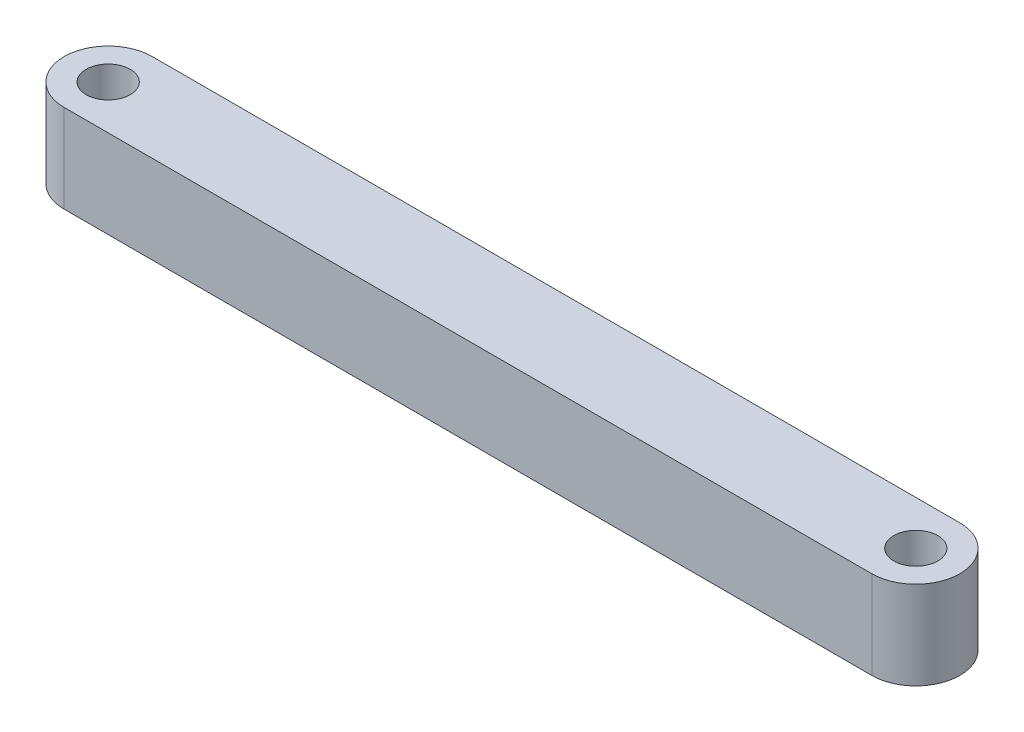
ISO-10303-21;
HEADER;
FILE_DESCRIPTION(('STEP AP214'),'2;1');
FILE_NAME('part.step','',(''),(''),'','','');
FILE_SCHEMA(('AUTOMOTIVE_DESIGN { 1 0 10303 214 1 1 1 1 }'));
ENDSEC;
DATA;
#1=APPLICATION_CONTEXT('core data for automotive mechanical design processes');
#2=APPLICATION_PROTOCOL_DEFINITION('international standard','automotive_design',2000,#1);
#3=PRODUCT_CONTEXT('',#1,'mechanical');
#4=PRODUCT('Part','Part','',(#3));
#5=PRODUCT_RELATED_PRODUCT_CATEGORY('part','',(#4));
#6=PRODUCT_DEFINITION_FORMATION('','',#4);
#7=PRODUCT_DEFINITION_CONTEXT('part definition',#1,'design');
#8=PRODUCT_DEFINITION('design','',#6,#7);
#9=PRODUCT_DEFINITION_SHAPE('','',#8);
#10=(LENGTH_UNIT() NAMED_UNIT(*) SI_UNIT(.MILLI.,.METRE.));
#11=(NAMED_UNIT(*) PLANE_ANGLE_UNIT() SI_UNIT($,.RADIAN.));
#12=(NAMED_UNIT(*) SI_UNIT($,.STERADIAN.) SOLID_ANGLE_UNIT());
#13=UNCERTAINTY_MEASURE_WITH_UNIT(LENGTH_MEASURE(1.E-05),#10,'distance_accuracy_value','');
#14=(GEOMETRIC_REPRESENTATION_CONTEXT(3) GLOBAL_UNCERTAINTY_ASSIGNED_CONTEXT((#13)) GLOBAL_UNIT_ASSIGNED_CONTEXT((#10,
#11,#12)) REPRESENTATION_CONTEXT('',''));
#15=CARTESIAN_POINT('',(0.,0.,0.));
#16=DIRECTION('',(0.,0.,1.));
#17=DIRECTION('',(1.,0.,0.));
#18=AXIS2_PLACEMENT_3D('',#15,#16,#17);
#19=CARTESIAN_POINT('',(0.,6.,-2.99999999999999));
#20=DIRECTION('',(0.,-1.,0.));
#21=DIRECTION('',(0.,0.,-1.));
#22=AXIS2_PLACEMENT_3D('',#19,#20,#21);
#23=PLANE('',#22);
#24=CARTESIAN_POINT('',(0.,6.,-2.99999999999999));
#25=DIRECTION('',(0.,1.,0.));
#26=DIRECTION('',(0.,0.,-1.));
#27=AXIS2_PLACEMENT_3D('',#24,#25,#26);
#28=CIRCLE('',#27,3.);
#29=CARTESIAN_POINT('',(0.,6.,0.));
#30=VERTEX_POINT('',#29);
#31=CARTESIAN_POINT('',(0.,6.,-6.));
#32=VERTEX_POINT('',#31);
#33=EDGE_CURVE('E85',#30,#32,#28,.T.);
#34=ORIENTED_EDGE('',*,*,#33,.T.);
#35=DIRECTION('',(-1.,0.,0.));
#36=VECTOR('',#35,1.);
#37=CARTESIAN_POINT('',(0.,6.,-6.));
#38=LINE('',#37,#36);
#39=CARTESIAN_POINT('',(-55.,6.,-5.99999999999999));
#40=VERTEX_POINT('',#39);
#41=EDGE_CURVE('E80',#32,#40,#38,.T.);
#42=ORIENTED_EDGE('',*,*,#41,.T.);
#43=CARTESIAN_POINT('',(-55.,6.,-2.99999999999999));
#44=DIRECTION('',(0.,1.,0.));
#45=DIRECTION('',(0.,0.,1.));
#46=AXIS2_PLACEMENT_3D('',#43,#44,#45);
#47=CIRCLE('',#46,3.);
#48=CARTESIAN_POINT('',(-55.,6.,0.));
#49=VERTEX_POINT('',#48);
#50=EDGE_CURVE('E83',#40,#49,#47,.T.);
#51=ORIENTED_EDGE('',*,*,#50,.T.);
#52=DIRECTION('',(1.,0.,0.));
#53=VECTOR('',#52,1.);
#54=CARTESIAN_POINT('',(0.,6.,0.));
#55=LINE('',#54,#53);
#56=EDGE_CURVE('E50',#49,#30,#55,.T.);
#57=ORIENTED_EDGE('',*,*,#56,.T.);
#58=EDGE_LOOP('',(#34,#42,#51,#57));
#59=FACE_BOUND('',#58,.T.);
#60=CARTESIAN_POINT('',(-55.,6.,-2.99999999999999));
#61=DIRECTION('',(0.,1.,0.));
#62=DIRECTION('',(0.,0.,1.));
#63=AXIS2_PLACEMENT_3D('',#60,#61,#62);
#64=CIRCLE('',#63,1.5);
#65=CARTESIAN_POINT('',(-55.,6.,-1.5));
#66=VERTEX_POINT('',#65);
#67=EDGE_CURVE('E100',#66,#66,#64,.T.);
#68=ORIENTED_EDGE('',*,*,#67,.F.);
#69=EDGE_LOOP('',(#68));
#70=FACE_BOUND('',#69,.T.);
#71=CARTESIAN_POINT('',(0.,6.,-2.99999999999999));
#72=DIRECTION('',(0.,1.,0.));
#73=DIRECTION('',(0.,0.,-1.));
#74=AXIS2_PLACEMENT_3D('',#71,#72,#73);
#75=CIRCLE('',#74,1.5);
#76=CARTESIAN_POINT('',(0.,6.,-4.49999999999999));
#77=VERTEX_POINT('',#76);
#78=EDGE_CURVE('E115',#77,#77,#75,.T.);
#79=ORIENTED_EDGE('',*,*,#78,.F.);
#80=EDGE_LOOP('',(#79));
#81=FACE_BOUND('',#80,.T.);
#82=ADVANCED_FACE('F33',(#59,#70,#81),#23,.F.);
#83=CARTESIAN_POINT('',(0.,0.,-2.99999999999999));
#84=DIRECTION('',(0.,-1.,0.));
#85=DIRECTION('',(0.,0.,-1.));
#86=AXIS2_PLACEMENT_3D('',#83,#84,#85);
#87=PLANE('',#86);
#88=CARTESIAN_POINT('',(-55.,0.,-2.99999999999999));
#89=DIRECTION('',(0.,1.,0.));
#90=DIRECTION('',(0.,0.,1.));
#91=AXIS2_PLACEMENT_3D('',#88,#89,#90);
#92=CIRCLE('',#91,1.5);
#93=CARTESIAN_POINT('',(-55.,0.,-1.5));
#94=VERTEX_POINT('',#93);
#95=EDGE_CURVE('E112',#94,#94,#92,.T.);
#96=ORIENTED_EDGE('',*,*,#95,.T.);
#97=EDGE_LOOP('',(#96));
#98=FACE_BOUND('',#97,.T.);
#99=CARTESIAN_POINT('',(0.,0.,-2.99999999999999));
#100=DIRECTION('',(0.,1.,0.));
#101=DIRECTION('',(0.,0.,-1.));
#102=AXIS2_PLACEMENT_3D('',#99,#100,#101);
#103=CIRCLE('',#102,3.);
#104=CARTESIAN_POINT('',(0.,0.,0.));
#105=VERTEX_POINT('',#104);
#106=CARTESIAN_POINT('',(0.,0.,-6.));
#107=VERTEX_POINT('',#106);
#108=EDGE_CURVE('E97',#105,#107,#103,.T.);
#109=ORIENTED_EDGE('',*,*,#108,.F.);
#110=DIRECTION('',(1.,0.,0.));
#111=VECTOR('',#110,1.);
#112=CARTESIAN_POINT('',(0.,0.,0.));
#113=LINE('',#112,#111);
#114=CARTESIAN_POINT('',(-55.,0.,0.));
#115=VERTEX_POINT('',#114);
#116=EDGE_CURVE('E73',#115,#105,#113,.T.);
#117=ORIENTED_EDGE('',*,*,#116,.F.);
#118=CARTESIAN_POINT('',(-55.,0.,-2.99999999999999));
#119=DIRECTION('',(0.,1.,0.));
#120=DIRECTION('',(0.,0.,1.));
#121=AXIS2_PLACEMENT_3D('',#118,#119,#120);
#122=CIRCLE('',#121,3.);
#123=CARTESIAN_POINT('',(-55.,0.,-5.99999999999999));
#124=VERTEX_POINT('',#123);
#125=EDGE_CURVE('E67',#124,#115,#122,.T.);
#126=ORIENTED_EDGE('',*,*,#125,.F.);
#127=DIRECTION('',(-1.,0.,0.));
#128=VECTOR('',#127,1.);
#129=CARTESIAN_POINT('',(0.,0.,-6.));
#130=LINE('',#129,#128);
#131=EDGE_CURVE('E89',#107,#124,#130,.T.);
#132=ORIENTED_EDGE('',*,*,#131,.F.);
#133=EDGE_LOOP('',(#109,#117,#126,#132));
#134=FACE_BOUND('',#133,.T.);
#135=CARTESIAN_POINT('',(0.,0.,-2.99999999999999));
#136=DIRECTION('',(0.,1.,0.));
#137=DIRECTION('',(0.,0.,-1.));
#138=AXIS2_PLACEMENT_3D('',#135,#136,#137);
#139=CIRCLE('',#138,1.5);
#140=CARTESIAN_POINT('',(0.,0.,-4.49999999999999));
#141=VERTEX_POINT('',#140);
#142=EDGE_CURVE('E118',#141,#141,#139,.T.);
#143=ORIENTED_EDGE('',*,*,#142,.T.);
#144=EDGE_LOOP('',(#143));
#145=FACE_BOUND('',#144,.T.);
#146=ADVANCED_FACE('F108',(#98,#134,#145),#87,.T.);
#147=CARTESIAN_POINT('',(0.,6.,-2.99999999999999));
#148=DIRECTION('',(0.,-1.,0.));
#149=DIRECTION('',(0.,0.,-1.));
#150=AXIS2_PLACEMENT_3D('',#147,#148,#149);
#151=CYLINDRICAL_SURFACE('',#150,3.);
#152=ORIENTED_EDGE('',*,*,#108,.T.);
#153=DIRECTION('',(0.,-1.,0.));
#154=VECTOR('',#153,1.);
#155=CARTESIAN_POINT('',(0.,6.,-6.));
#156=LINE('',#155,#154);
#157=EDGE_CURVE('E11',#32,#107,#156,.T.);
#158=ORIENTED_EDGE('',*,*,#157,.F.);
#159=ORIENTED_EDGE('',*,*,#33,.F.);
#160=DIRECTION('',(0.,-1.,0.));
#161=VECTOR('',#160,1.);
#162=CARTESIAN_POINT('',(0.,6.,0.));
#163=LINE('',#162,#161);
#164=EDGE_CURVE('E93',#30,#105,#163,.T.);
#165=ORIENTED_EDGE('',*,*,#164,.T.);
#166=EDGE_LOOP('',(#152,#158,#159,#165));
#167=FACE_BOUND('',#166,.T.);
#168=ADVANCED_FACE('F35',(#167),#151,.T.);
#169=CARTESIAN_POINT('',(0.,6.,-6.));
#170=DIRECTION('',(0.,0.,1.));
#171=DIRECTION('',(1.,0.,0.));
#172=AXIS2_PLACEMENT_3D('',#169,#170,#171);
#173=PLANE('',#172);
#174=ORIENTED_EDGE('',*,*,#131,.T.);
#175=DIRECTION('',(0.,-1.,0.));
#176=VECTOR('',#175,1.);
#177=CARTESIAN_POINT('',(-55.,6.,-5.99999999999999));
#178=LINE('',#177,#176);
#179=EDGE_CURVE('E42',#40,#124,#178,.T.);
#180=ORIENTED_EDGE('',*,*,#179,.F.);
#181=ORIENTED_EDGE('',*,*,#41,.F.);
#182=ORIENTED_EDGE('',*,*,#157,.T.);
#183=EDGE_LOOP('',(#174,#180,#181,#182));
#184=FACE_BOUND('',#183,.T.);
#185=ADVANCED_FACE('F88',(#184),#173,.F.);
#186=CARTESIAN_POINT('',(-55.,6.,-2.99999999999999));
#187=DIRECTION('',(0.,-1.,0.));
#188=DIRECTION('',(0.,0.,-1.));
#189=AXIS2_PLACEMENT_3D('',#186,#187,#188);
#190=CYLINDRICAL_SURFACE('',#189,3.);
#191=ORIENTED_EDGE('',*,*,#125,.T.);
#192=DIRECTION('',(0.,-1.,0.));
#193=VECTOR('',#192,1.);
#194=CARTESIAN_POINT('',(-55.,6.,0.));
#195=LINE('',#194,#193);
#196=EDGE_CURVE('E90',#49,#115,#195,.T.);
#197=ORIENTED_EDGE('',*,*,#196,.F.);
#198=ORIENTED_EDGE('',*,*,#50,.F.);
#199=ORIENTED_EDGE('',*,*,#179,.T.);
#200=EDGE_LOOP('',(#191,#197,#198,#199));
#201=FACE_BOUND('',#200,.T.);
#202=ADVANCED_FACE('F91',(#201),#190,.T.);
#203=CARTESIAN_POINT('',(0.,6.,0.));
#204=DIRECTION('',(0.,0.,-1.));
#205=DIRECTION('',(-1.,0.,0.));
#206=AXIS2_PLACEMENT_3D('',#203,#204,#205);
#207=PLANE('',#206);
#208=ORIENTED_EDGE('',*,*,#116,.T.);
#209=ORIENTED_EDGE('',*,*,#164,.F.);
#210=ORIENTED_EDGE('',*,*,#56,.F.);
#211=ORIENTED_EDGE('',*,*,#196,.T.);
#212=EDGE_LOOP('',(#208,#209,#210,#211));
#213=FACE_BOUND('',#212,.T.);
#214=ADVANCED_FACE('F105',(#213),#207,.F.);
#215=CARTESIAN_POINT('',(-55.,6.,-2.99999999999999));
#216=DIRECTION('',(0.,-1.,0.));
#217=DIRECTION('',(0.,0.,-1.));
#218=AXIS2_PLACEMENT_3D('',#215,#216,#217);
#219=CYLINDRICAL_SURFACE('',#218,1.5);
#220=ORIENTED_EDGE('',*,*,#67,.T.);
#221=EDGE_LOOP('',(#220));
#222=FACE_BOUND('',#221,.T.);
#223=ORIENTED_EDGE('',*,*,#95,.F.);
#224=EDGE_LOOP('',(#223));
#225=FACE_BOUND('',#224,.T.);
#226=ADVANCED_FACE('F135',(#222,#225),#219,.F.);
#227=CARTESIAN_POINT('',(0.,6.,-2.99999999999999));
#228=DIRECTION('',(0.,-1.,0.));
#229=DIRECTION('',(0.,0.,-1.));
#230=AXIS2_PLACEMENT_3D('',#227,#228,#229);
#231=CYLINDRICAL_SURFACE('',#230,1.5);
#232=ORIENTED_EDGE('',*,*,#78,.T.);
#233=EDGE_LOOP('',(#232));
#234=FACE_BOUND('',#233,.T.);
#235=ORIENTED_EDGE('',*,*,#142,.F.);
#236=EDGE_LOOP('',(#235));
#237=FACE_BOUND('',#236,.T.);
#238=ADVANCED_FACE('F124',(#234,#237),#231,.F.);
#239=CLOSED_SHELL('',(#82,#146,#168,#185,#202,#214,#226,#238));
#240=MANIFOLD_SOLID_BREP('B2',#239);
#241=ADVANCED_BREP_SHAPE_REPRESENTATION('',(#18,#240),#14);
#242=SHAPE_DEFINITION_REPRESENTATION(#9,#241);
ENDSEC;
END-ISO-10303-21;
